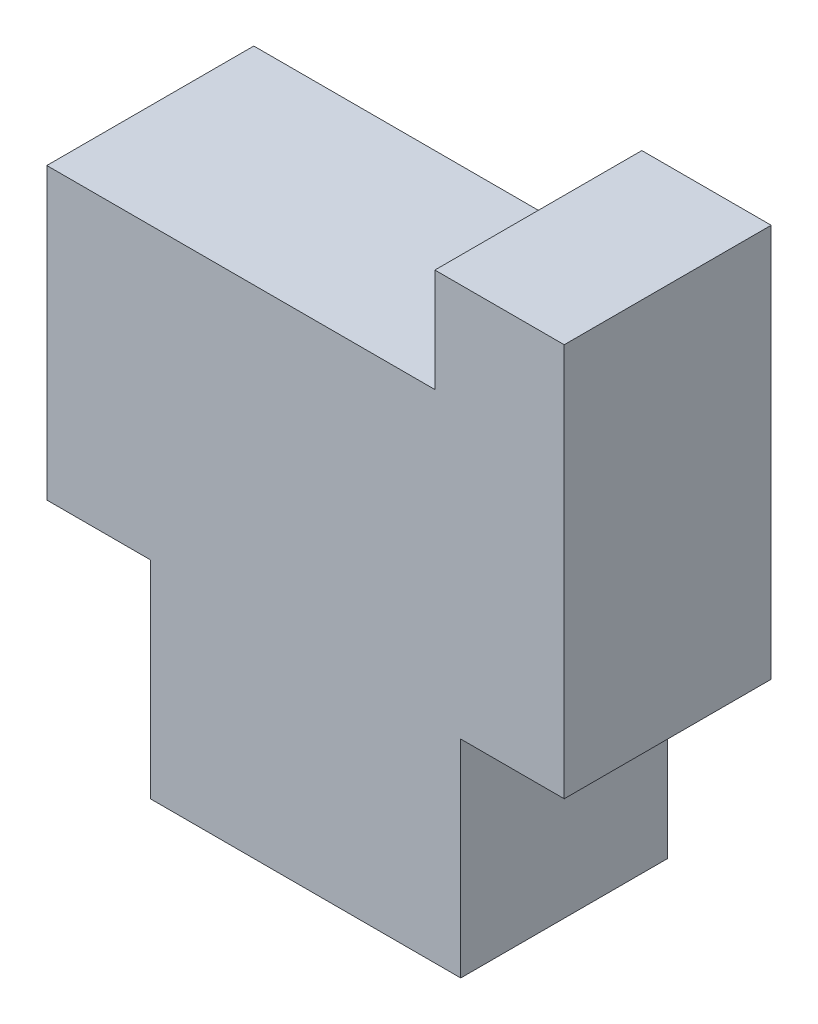
ISO-10303-21;
HEADER;
FILE_DESCRIPTION(('STEP AP214'),'2;1');
FILE_NAME('part.step','',(''),(''),'','','');
FILE_SCHEMA(('AUTOMOTIVE_DESIGN { 1 0 10303 214 1 1 1 1 }'));
ENDSEC;
DATA;
#1=APPLICATION_CONTEXT('core data for automotive mechanical design processes');
#2=APPLICATION_PROTOCOL_DEFINITION('international standard','automotive_design',2000,#1);
#3=PRODUCT_CONTEXT('',#1,'mechanical');
#4=PRODUCT('Part','Part','',(#3));
#5=PRODUCT_RELATED_PRODUCT_CATEGORY('part','',(#4));
#6=PRODUCT_DEFINITION_FORMATION('','',#4);
#7=PRODUCT_DEFINITION_CONTEXT('part definition',#1,'design');
#8=PRODUCT_DEFINITION('design','',#6,#7);
#9=PRODUCT_DEFINITION_SHAPE('','',#8);
#10=(LENGTH_UNIT() NAMED_UNIT(*) SI_UNIT(.MILLI.,.METRE.));
#11=(NAMED_UNIT(*) PLANE_ANGLE_UNIT() SI_UNIT($,.RADIAN.));
#12=(NAMED_UNIT(*) SI_UNIT($,.STERADIAN.) SOLID_ANGLE_UNIT());
#13=UNCERTAINTY_MEASURE_WITH_UNIT(LENGTH_MEASURE(1.E-05),#10,'distance_accuracy_value','');
#14=(GEOMETRIC_REPRESENTATION_CONTEXT(3) GLOBAL_UNCERTAINTY_ASSIGNED_CONTEXT((#13)) GLOBAL_UNIT_ASSIGNED_CONTEXT((#10,
#11,#12)) REPRESENTATION_CONTEXT('',''));
#15=CARTESIAN_POINT('',(0.,0.,0.));
#16=DIRECTION('',(0.,0.,1.));
#17=DIRECTION('',(1.,0.,0.));
#18=AXIS2_PLACEMENT_3D('',#15,#16,#17);
#19=CARTESIAN_POINT('',(0.,0.,4.));
#20=DIRECTION('',(1.,0.,0.));
#21=DIRECTION('',(0.,0.,-1.));
#22=AXIS2_PLACEMENT_3D('',#19,#20,#21);
#23=PLANE('',#22);
#24=DIRECTION('',(0.,-1.,0.));
#25=VECTOR('',#24,1.);
#26=CARTESIAN_POINT('',(0.,0.,0.));
#27=LINE('',#26,#25);
#28=CARTESIAN_POINT('',(0.,4.,0.));
#29=VERTEX_POINT('',#28);
#30=CARTESIAN_POINT('',(0.,0.,0.));
#31=VERTEX_POINT('',#30);
#32=EDGE_CURVE('E141',#29,#31,#27,.T.);
#33=ORIENTED_EDGE('',*,*,#32,.T.);
#34=DIRECTION('',(0.,0.,-1.));
#35=VECTOR('',#34,1.);
#36=CARTESIAN_POINT('',(0.,0.,4.));
#37=LINE('',#36,#35);
#38=CARTESIAN_POINT('',(0.,0.,4.));
#39=VERTEX_POINT('',#38);
#40=EDGE_CURVE('E11',#39,#31,#37,.T.);
#41=ORIENTED_EDGE('',*,*,#40,.F.);
#42=DIRECTION('',(0.,-1.,0.));
#43=VECTOR('',#42,1.);
#44=CARTESIAN_POINT('',(0.,0.,4.));
#45=LINE('',#44,#43);
#46=CARTESIAN_POINT('',(0.,4.,4.));
#47=VERTEX_POINT('',#46);
#48=EDGE_CURVE('E159',#47,#39,#45,.T.);
#49=ORIENTED_EDGE('',*,*,#48,.F.);
#50=DIRECTION('',(0.,0.,-1.));
#51=VECTOR('',#50,1.);
#52=CARTESIAN_POINT('',(0.,4.,4.));
#53=LINE('',#52,#51);
#54=EDGE_CURVE('E137',#47,#29,#53,.T.);
#55=ORIENTED_EDGE('',*,*,#54,.T.);
#56=EDGE_LOOP('',(#33,#41,#49,#55));
#57=FACE_BOUND('',#56,.T.);
#58=ADVANCED_FACE('F33',(#57),#23,.F.);
#59=CARTESIAN_POINT('',(0.,0.,4.));
#60=DIRECTION('',(0.,1.,0.));
#61=DIRECTION('',(0.,0.,1.));
#62=AXIS2_PLACEMENT_3D('',#59,#60,#61);
#63=PLANE('',#62);
#64=DIRECTION('',(1.,0.,0.));
#65=VECTOR('',#64,1.);
#66=CARTESIAN_POINT('',(0.,0.,0.));
#67=LINE('',#66,#65);
#68=CARTESIAN_POINT('',(6.,0.,0.));
#69=VERTEX_POINT('',#68);
#70=EDGE_CURVE('E144',#31,#69,#67,.T.);
#71=ORIENTED_EDGE('',*,*,#70,.T.);
#72=DIRECTION('',(0.,0.,-1.));
#73=VECTOR('',#72,1.);
#74=CARTESIAN_POINT('',(6.,0.,4.));
#75=LINE('',#74,#73);
#76=CARTESIAN_POINT('',(6.,0.,4.));
#77=VERTEX_POINT('',#76);
#78=EDGE_CURVE('E41',#77,#69,#75,.T.);
#79=ORIENTED_EDGE('',*,*,#78,.F.);
#80=DIRECTION('',(1.,0.,0.));
#81=VECTOR('',#80,1.);
#82=CARTESIAN_POINT('',(0.,0.,4.));
#83=LINE('',#82,#81);
#84=EDGE_CURVE('E98',#39,#77,#83,.T.);
#85=ORIENTED_EDGE('',*,*,#84,.F.);
#86=ORIENTED_EDGE('',*,*,#40,.T.);
#87=EDGE_LOOP('',(#71,#79,#85,#86));
#88=FACE_BOUND('',#87,.T.);
#89=ADVANCED_FACE('F208',(#88),#63,.F.);
#90=CARTESIAN_POINT('',(6.,0.,4.));
#91=DIRECTION('',(-1.,0.,0.));
#92=DIRECTION('',(0.,0.,1.));
#93=AXIS2_PLACEMENT_3D('',#90,#91,#92);
#94=PLANE('',#93);
#95=DIRECTION('',(0.,1.,0.));
#96=VECTOR('',#95,1.);
#97=CARTESIAN_POINT('',(6.,0.,0.));
#98=LINE('',#97,#96);
#99=CARTESIAN_POINT('',(6.,4.,0.));
#100=VERTEX_POINT('',#99);
#101=EDGE_CURVE('E146',#69,#100,#98,.T.);
#102=ORIENTED_EDGE('',*,*,#101,.T.);
#103=DIRECTION('',(0.,0.,-1.));
#104=VECTOR('',#103,1.);
#105=CARTESIAN_POINT('',(6.,4.,4.));
#106=LINE('',#105,#104);
#107=CARTESIAN_POINT('',(6.,4.,4.));
#108=VERTEX_POINT('',#107);
#109=EDGE_CURVE('E172',#108,#100,#106,.T.);
#110=ORIENTED_EDGE('',*,*,#109,.F.);
#111=DIRECTION('',(0.,1.,0.));
#112=VECTOR('',#111,1.);
#113=CARTESIAN_POINT('',(6.,0.,4.));
#114=LINE('',#113,#112);
#115=EDGE_CURVE('E180',#77,#108,#114,.T.);
#116=ORIENTED_EDGE('',*,*,#115,.F.);
#117=ORIENTED_EDGE('',*,*,#78,.T.);
#118=EDGE_LOOP('',(#102,#110,#116,#117));
#119=FACE_BOUND('',#118,.T.);
#120=ADVANCED_FACE('F178',(#119),#94,.F.);
#121=CARTESIAN_POINT('',(6.,4.,4.));
#122=DIRECTION('',(0.,1.,0.));
#123=DIRECTION('',(0.,0.,1.));
#124=AXIS2_PLACEMENT_3D('',#121,#122,#123);
#125=PLANE('',#124);
#126=DIRECTION('',(1.,0.,0.));
#127=VECTOR('',#126,1.);
#128=CARTESIAN_POINT('',(6.,4.,0.));
#129=LINE('',#128,#127);
#130=CARTESIAN_POINT('',(8.,4.,0.));
#131=VERTEX_POINT('',#130);
#132=EDGE_CURVE('E148',#100,#131,#129,.T.);
#133=ORIENTED_EDGE('',*,*,#132,.T.);
#134=DIRECTION('',(0.,0.,-1.));
#135=VECTOR('',#134,1.);
#136=CARTESIAN_POINT('',(8.,4.,4.));
#137=LINE('',#136,#135);
#138=CARTESIAN_POINT('',(8.,4.,4.));
#139=VERTEX_POINT('',#138);
#140=EDGE_CURVE('E169',#139,#131,#137,.T.);
#141=ORIENTED_EDGE('',*,*,#140,.F.);
#142=DIRECTION('',(1.,0.,0.));
#143=VECTOR('',#142,1.);
#144=CARTESIAN_POINT('',(6.,4.,4.));
#145=LINE('',#144,#143);
#146=EDGE_CURVE('E198',#108,#139,#145,.T.);
#147=ORIENTED_EDGE('',*,*,#146,.F.);
#148=ORIENTED_EDGE('',*,*,#109,.T.);
#149=EDGE_LOOP('',(#133,#141,#147,#148));
#150=FACE_BOUND('',#149,.T.);
#151=ADVANCED_FACE('F189',(#150),#125,.F.);
#152=CARTESIAN_POINT('',(8.,11.6,4.));
#153=DIRECTION('',(-1.,0.,0.));
#154=DIRECTION('',(0.,-1.,0.));
#155=AXIS2_PLACEMENT_3D('',#152,#153,#154);
#156=PLANE('',#155);
#157=DIRECTION('',(0.,1.,0.));
#158=VECTOR('',#157,1.);
#159=CARTESIAN_POINT('',(8.,11.6,0.));
#160=LINE('',#159,#158);
#161=CARTESIAN_POINT('',(8.,11.6,0.));
#162=VERTEX_POINT('',#161);
#163=EDGE_CURVE('E150',#131,#162,#160,.T.);
#164=ORIENTED_EDGE('',*,*,#163,.T.);
#165=DIRECTION('',(0.,0.,-1.));
#166=VECTOR('',#165,1.);
#167=CARTESIAN_POINT('',(8.,11.6,4.));
#168=LINE('',#167,#166);
#169=CARTESIAN_POINT('',(8.,11.6,4.));
#170=VERTEX_POINT('',#169);
#171=EDGE_CURVE('E166',#170,#162,#168,.T.);
#172=ORIENTED_EDGE('',*,*,#171,.F.);
#173=DIRECTION('',(0.,1.,0.));
#174=VECTOR('',#173,1.);
#175=CARTESIAN_POINT('',(8.,11.6,4.));
#176=LINE('',#175,#174);
#177=EDGE_CURVE('E195',#139,#170,#176,.T.);
#178=ORIENTED_EDGE('',*,*,#177,.F.);
#179=ORIENTED_EDGE('',*,*,#140,.T.);
#180=EDGE_LOOP('',(#164,#172,#178,#179));
#181=FACE_BOUND('',#180,.T.);
#182=ADVANCED_FACE('F193',(#181),#156,.F.);
#183=CARTESIAN_POINT('',(5.49999999999999,11.6,4.));
#184=DIRECTION('',(0.,-1.,0.));
#185=DIRECTION('',(0.,0.,-1.));
#186=AXIS2_PLACEMENT_3D('',#183,#184,#185);
#187=PLANE('',#186);
#188=DIRECTION('',(-1.,0.,0.));
#189=VECTOR('',#188,1.);
#190=CARTESIAN_POINT('',(5.49999999999999,11.6,0.));
#191=LINE('',#190,#189);
#192=CARTESIAN_POINT('',(5.49999999999999,11.6,0.));
#193=VERTEX_POINT('',#192);
#194=EDGE_CURVE('E152',#162,#193,#191,.T.);
#195=ORIENTED_EDGE('',*,*,#194,.T.);
#196=DIRECTION('',(0.,0.,-1.));
#197=VECTOR('',#196,1.);
#198=CARTESIAN_POINT('',(5.49999999999999,11.6,4.));
#199=LINE('',#198,#197);
#200=CARTESIAN_POINT('',(5.49999999999999,11.6,4.));
#201=VERTEX_POINT('',#200);
#202=EDGE_CURVE('E163',#201,#193,#199,.T.);
#203=ORIENTED_EDGE('',*,*,#202,.F.);
#204=DIRECTION('',(-1.,0.,0.));
#205=VECTOR('',#204,1.);
#206=CARTESIAN_POINT('',(5.49999999999999,11.6,4.));
#207=LINE('',#206,#205);
#208=EDGE_CURVE('E197',#170,#201,#207,.T.);
#209=ORIENTED_EDGE('',*,*,#208,.F.);
#210=ORIENTED_EDGE('',*,*,#171,.T.);
#211=EDGE_LOOP('',(#195,#203,#209,#210));
#212=FACE_BOUND('',#211,.T.);
#213=ADVANCED_FACE('F220',(#212),#187,.F.);
#214=CARTESIAN_POINT('',(5.49999999999999,9.6,4.));
#215=DIRECTION('',(1.,0.,0.));
#216=DIRECTION('',(0.,0.,-1.));
#217=AXIS2_PLACEMENT_3D('',#214,#215,#216);
#218=PLANE('',#217);
#219=DIRECTION('',(0.,-1.,0.));
#220=VECTOR('',#219,1.);
#221=CARTESIAN_POINT('',(5.49999999999999,9.6,0.));
#222=LINE('',#221,#220);
#223=CARTESIAN_POINT('',(5.49999999999999,9.6,0.));
#224=VERTEX_POINT('',#223);
#225=EDGE_CURVE('E154',#193,#224,#222,.T.);
#226=ORIENTED_EDGE('',*,*,#225,.T.);
#227=DIRECTION('',(0.,0.,-1.));
#228=VECTOR('',#227,1.);
#229=CARTESIAN_POINT('',(5.49999999999999,9.6,4.));
#230=LINE('',#229,#228);
#231=CARTESIAN_POINT('',(5.49999999999999,9.6,4.));
#232=VERTEX_POINT('',#231);
#233=EDGE_CURVE('E132',#232,#224,#230,.T.);
#234=ORIENTED_EDGE('',*,*,#233,.F.);
#235=DIRECTION('',(0.,-1.,0.));
#236=VECTOR('',#235,1.);
#237=CARTESIAN_POINT('',(5.49999999999999,9.6,4.));
#238=LINE('',#237,#236);
#239=EDGE_CURVE('E123',#201,#232,#238,.T.);
#240=ORIENTED_EDGE('',*,*,#239,.F.);
#241=ORIENTED_EDGE('',*,*,#202,.T.);
#242=EDGE_LOOP('',(#226,#234,#240,#241));
#243=FACE_BOUND('',#242,.T.);
#244=ADVANCED_FACE('F223',(#243),#218,.F.);
#245=CARTESIAN_POINT('',(-2.,9.6,4.));
#246=DIRECTION('',(0.,-1.,0.));
#247=DIRECTION('',(0.,0.,-1.));
#248=AXIS2_PLACEMENT_3D('',#245,#246,#247);
#249=PLANE('',#248);
#250=DIRECTION('',(-1.,0.,0.));
#251=VECTOR('',#250,1.);
#252=CARTESIAN_POINT('',(-2.,9.6,0.));
#253=LINE('',#252,#251);
#254=CARTESIAN_POINT('',(-2.,9.6,0.));
#255=VERTEX_POINT('',#254);
#256=EDGE_CURVE('E131',#224,#255,#253,.T.);
#257=ORIENTED_EDGE('',*,*,#256,.T.);
#258=DIRECTION('',(0.,0.,-1.));
#259=VECTOR('',#258,1.);
#260=CARTESIAN_POINT('',(-2.,9.6,4.));
#261=LINE('',#260,#259);
#262=CARTESIAN_POINT('',(-2.,9.6,4.));
#263=VERTEX_POINT('',#262);
#264=EDGE_CURVE('E128',#263,#255,#261,.T.);
#265=ORIENTED_EDGE('',*,*,#264,.F.);
#266=DIRECTION('',(-1.,0.,0.));
#267=VECTOR('',#266,1.);
#268=CARTESIAN_POINT('',(-2.,9.6,4.));
#269=LINE('',#268,#267);
#270=EDGE_CURVE('E117',#232,#263,#269,.T.);
#271=ORIENTED_EDGE('',*,*,#270,.F.);
#272=ORIENTED_EDGE('',*,*,#233,.T.);
#273=EDGE_LOOP('',(#257,#265,#271,#272));
#274=FACE_BOUND('',#273,.T.);
#275=ADVANCED_FACE('F129',(#274),#249,.F.);
#276=CARTESIAN_POINT('',(-2.,4.,4.));
#277=DIRECTION('',(1.,0.,0.));
#278=DIRECTION('',(0.,1.,0.));
#279=AXIS2_PLACEMENT_3D('',#276,#277,#278);
#280=PLANE('',#279);
#281=DIRECTION('',(0.,-1.,0.));
#282=VECTOR('',#281,1.);
#283=CARTESIAN_POINT('',(-2.,4.,0.));
#284=LINE('',#283,#282);
#285=CARTESIAN_POINT('',(-2.,4.,0.));
#286=VERTEX_POINT('',#285);
#287=EDGE_CURVE('E84',#255,#286,#284,.T.);
#288=ORIENTED_EDGE('',*,*,#287,.T.);
#289=DIRECTION('',(0.,0.,-1.));
#290=VECTOR('',#289,1.);
#291=CARTESIAN_POINT('',(-2.,4.,4.));
#292=LINE('',#291,#290);
#293=CARTESIAN_POINT('',(-2.,4.,4.));
#294=VERTEX_POINT('',#293);
#295=EDGE_CURVE('E133',#294,#286,#292,.T.);
#296=ORIENTED_EDGE('',*,*,#295,.F.);
#297=DIRECTION('',(0.,-1.,0.));
#298=VECTOR('',#297,1.);
#299=CARTESIAN_POINT('',(-2.,4.,4.));
#300=LINE('',#299,#298);
#301=EDGE_CURVE('E121',#263,#294,#300,.T.);
#302=ORIENTED_EDGE('',*,*,#301,.F.);
#303=ORIENTED_EDGE('',*,*,#264,.T.);
#304=EDGE_LOOP('',(#288,#296,#302,#303));
#305=FACE_BOUND('',#304,.T.);
#306=ADVANCED_FACE('F135',(#305),#280,.F.);
#307=CARTESIAN_POINT('',(0.,4.,4.));
#308=DIRECTION('',(0.,1.,0.));
#309=DIRECTION('',(0.,0.,1.));
#310=AXIS2_PLACEMENT_3D('',#307,#308,#309);
#311=PLANE('',#310);
#312=DIRECTION('',(1.,0.,0.));
#313=VECTOR('',#312,1.);
#314=CARTESIAN_POINT('',(0.,4.,0.));
#315=LINE('',#314,#313);
#316=EDGE_CURVE('E90',#286,#29,#315,.T.);
#317=ORIENTED_EDGE('',*,*,#316,.T.);
#318=ORIENTED_EDGE('',*,*,#54,.F.);
#319=DIRECTION('',(1.,0.,0.));
#320=VECTOR('',#319,1.);
#321=CARTESIAN_POINT('',(0.,4.,4.));
#322=LINE('',#321,#320);
#323=EDGE_CURVE('E49',#294,#47,#322,.T.);
#324=ORIENTED_EDGE('',*,*,#323,.F.);
#325=ORIENTED_EDGE('',*,*,#295,.T.);
#326=EDGE_LOOP('',(#317,#318,#324,#325));
#327=FACE_BOUND('',#326,.T.);
#328=ADVANCED_FACE('F232',(#327),#311,.F.);
#329=CARTESIAN_POINT('',(0.,0.,4.));
#330=DIRECTION('',(0.,0.,1.));
#331=DIRECTION('',(1.,0.,0.));
#332=AXIS2_PLACEMENT_3D('',#329,#330,#331);
#333=PLANE('',#332);
#334=ORIENTED_EDGE('',*,*,#48,.T.);
#335=ORIENTED_EDGE('',*,*,#84,.T.);
#336=ORIENTED_EDGE('',*,*,#115,.T.);
#337=ORIENTED_EDGE('',*,*,#146,.T.);
#338=ORIENTED_EDGE('',*,*,#177,.T.);
#339=ORIENTED_EDGE('',*,*,#208,.T.);
#340=ORIENTED_EDGE('',*,*,#239,.T.);
#341=ORIENTED_EDGE('',*,*,#270,.T.);
#342=ORIENTED_EDGE('',*,*,#301,.T.);
#343=ORIENTED_EDGE('',*,*,#323,.T.);
#344=EDGE_LOOP('',(#334,#335,#336,#337,#338,#339,#340,#341,#342,#343));
#345=FACE_BOUND('',#344,.T.);
#346=ADVANCED_FACE('F119',(#345),#333,.T.);
#347=CARTESIAN_POINT('',(0.,0.,0.));
#348=DIRECTION('',(0.,0.,1.));
#349=DIRECTION('',(1.,0.,0.));
#350=AXIS2_PLACEMENT_3D('',#347,#348,#349);
#351=PLANE('',#350);
#352=ORIENTED_EDGE('',*,*,#32,.F.);
#353=ORIENTED_EDGE('',*,*,#316,.F.);
#354=ORIENTED_EDGE('',*,*,#287,.F.);
#355=ORIENTED_EDGE('',*,*,#256,.F.);
#356=ORIENTED_EDGE('',*,*,#225,.F.);
#357=ORIENTED_EDGE('',*,*,#194,.F.);
#358=ORIENTED_EDGE('',*,*,#163,.F.);
#359=ORIENTED_EDGE('',*,*,#132,.F.);
#360=ORIENTED_EDGE('',*,*,#101,.F.);
#361=ORIENTED_EDGE('',*,*,#70,.F.);
#362=EDGE_LOOP('',(#352,#353,#354,#355,#356,#357,#358,#359,#360,#361));
#363=FACE_BOUND('',#362,.T.);
#364=ADVANCED_FACE('F184',(#363),#351,.F.);
#365=CLOSED_SHELL('',(#58,#89,#120,#151,#182,#213,#244,#275,#306,#328,#346,#364));
#366=MANIFOLD_SOLID_BREP('B2',#365);
#367=ADVANCED_BREP_SHAPE_REPRESENTATION('',(#18,#366),#14);
#368=SHAPE_DEFINITION_REPRESENTATION(#9,#367);
ENDSEC;
END-ISO-10303-21;
